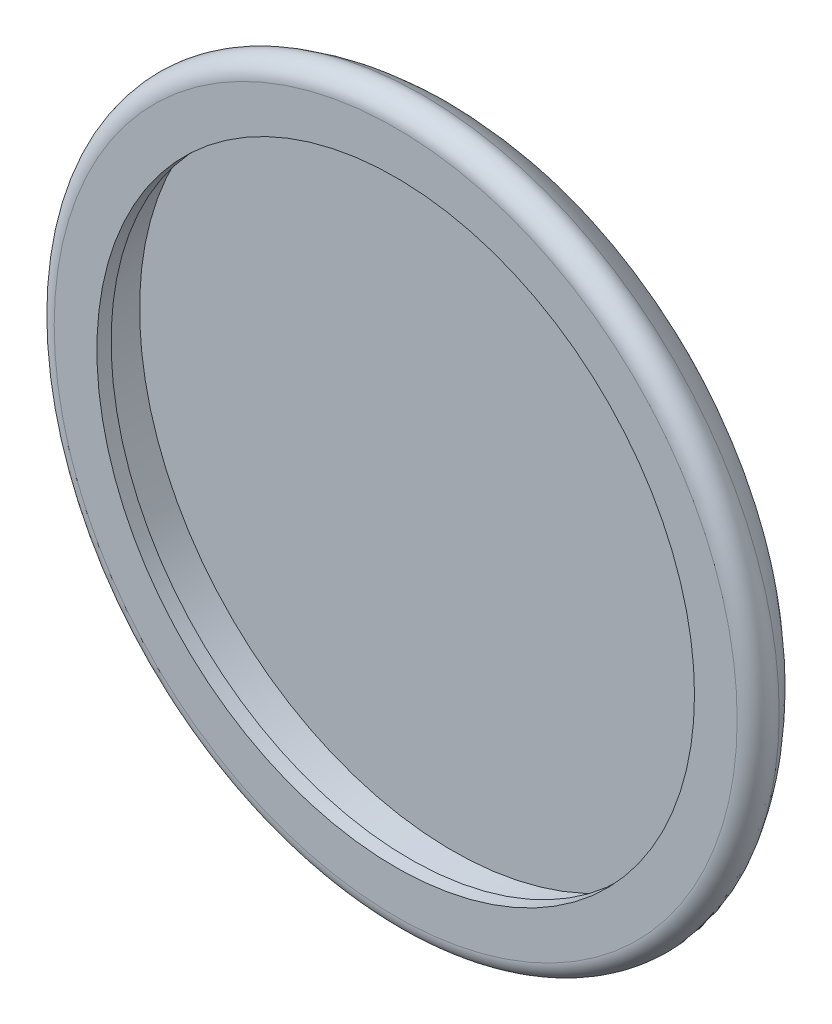
ISO-10303-21;
HEADER;
FILE_DESCRIPTION(('STEP AP214'),'2;1');
FILE_NAME('part.step','',(''),(''),'','','');
FILE_SCHEMA(('AUTOMOTIVE_DESIGN { 1 0 10303 214 1 1 1 1 }'));
ENDSEC;
DATA;
#1=APPLICATION_CONTEXT('core data for automotive mechanical design processes');
#2=APPLICATION_PROTOCOL_DEFINITION('international standard','automotive_design',2000,#1);
#3=PRODUCT_CONTEXT('',#1,'mechanical');
#4=PRODUCT('Part','Part','',(#3));
#5=PRODUCT_RELATED_PRODUCT_CATEGORY('part','',(#4));
#6=PRODUCT_DEFINITION_FORMATION('','',#4);
#7=PRODUCT_DEFINITION_CONTEXT('part definition',#1,'design');
#8=PRODUCT_DEFINITION('design','',#6,#7);
#9=PRODUCT_DEFINITION_SHAPE('','',#8);
#10=(LENGTH_UNIT() NAMED_UNIT(*) SI_UNIT(.MILLI.,.METRE.));
#11=(NAMED_UNIT(*) PLANE_ANGLE_UNIT() SI_UNIT($,.RADIAN.));
#12=(NAMED_UNIT(*) SI_UNIT($,.STERADIAN.) SOLID_ANGLE_UNIT());
#13=UNCERTAINTY_MEASURE_WITH_UNIT(LENGTH_MEASURE(1.E-05),#10,'distance_accuracy_value','');
#14=(GEOMETRIC_REPRESENTATION_CONTEXT(3) GLOBAL_UNCERTAINTY_ASSIGNED_CONTEXT((#13)) GLOBAL_UNIT_ASSIGNED_CONTEXT((#10,
#11,#12)) REPRESENTATION_CONTEXT('',''));
#15=CARTESIAN_POINT('',(0.,0.,0.));
#16=DIRECTION('',(0.,0.,1.));
#17=DIRECTION('',(1.,0.,0.));
#18=AXIS2_PLACEMENT_3D('',#15,#16,#17);
#19=CARTESIAN_POINT('',(0.,0.,-6.));
#20=DIRECTION('',(0.,0.,-1.));
#21=DIRECTION('',(-1.,0.,0.));
#22=AXIS2_PLACEMENT_3D('',#19,#20,#21);
#23=PLANE('',#22);
#24=CARTESIAN_POINT('',(0.,0.,-6.));
#25=DIRECTION('',(0.,0.,1.));
#26=DIRECTION('',(1.,0.,0.));
#27=AXIS2_PLACEMENT_3D('',#24,#25,#26);
#28=CIRCLE('',#27,18.);
#29=CARTESIAN_POINT('',(18.,0.,-6.));
#30=VERTEX_POINT('',#29);
#31=EDGE_CURVE('E10',#30,#30,#28,.T.);
#32=ORIENTED_EDGE('',*,*,#31,.F.);
#33=EDGE_LOOP('',(#32));
#34=FACE_BOUND('',#33,.T.);
#35=ADVANCED_FACE('F32',(#34),#23,.T.);
#36=CARTESIAN_POINT('',(0.,0.,2.14285714285715));
#37=DIRECTION('',(0.,0.,1.));
#38=DIRECTION('',(1.,0.,0.));
#39=AXIS2_PLACEMENT_3D('',#36,#37,#38);
#40=TOROIDAL_SURFACE('',#39,18.,8.14285714285714);
#41=ORIENTED_EDGE('',*,*,#31,.T.);
#42=EDGE_LOOP('',(#41));
#43=FACE_BOUND('',#42,.T.);
#44=CARTESIAN_POINT('',(0.,0.,-1.86528497409326));
#45=DIRECTION('',(0.,0.,1.));
#46=DIRECTION('',(1.,0.,0.));
#47=AXIS2_PLACEMENT_3D('',#44,#45,#46);
#48=CIRCLE('',#47,25.0880829015544);
#49=CARTESIAN_POINT('',(25.0880829015544,0.,-1.86528497409326));
#50=VERTEX_POINT('',#49);
#51=EDGE_CURVE('E38',#50,#50,#48,.T.);
#52=ORIENTED_EDGE('',*,*,#51,.F.);
#53=EDGE_LOOP('',(#52));
#54=FACE_BOUND('',#53,.T.);
#55=ADVANCED_FACE('F77',(#43,#54),#40,.T.);
#56=CARTESIAN_POINT('',(0.,0.,-1.25));
#57=DIRECTION('',(0.,0.,1.));
#58=DIRECTION('',(1.,0.,0.));
#59=AXIS2_PLACEMENT_3D('',#56,#57,#58);
#60=TOROIDAL_SURFACE('',#59,24.,1.25);
#61=ORIENTED_EDGE('',*,*,#51,.T.);
#62=EDGE_LOOP('',(#61));
#63=FACE_BOUND('',#62,.T.);
#64=CARTESIAN_POINT('',(0.,0.,0.));
#65=DIRECTION('',(0.,0.,1.));
#66=DIRECTION('',(1.,0.,0.));
#67=AXIS2_PLACEMENT_3D('',#64,#65,#66);
#68=CIRCLE('',#67,24.);
#69=CARTESIAN_POINT('',(24.,0.,0.));
#70=VERTEX_POINT('',#69);
#71=EDGE_CURVE('E42',#70,#70,#68,.T.);
#72=ORIENTED_EDGE('',*,*,#71,.F.);
#73=EDGE_LOOP('',(#72));
#74=FACE_BOUND('',#73,.T.);
#75=ADVANCED_FACE('F82',(#63,#74),#60,.T.);
#76=CARTESIAN_POINT('',(24.,0.,0.));
#77=DIRECTION('',(0.,0.,1.));
#78=DIRECTION('',(1.,0.,0.));
#79=AXIS2_PLACEMENT_3D('',#76,#77,#78);
#80=PLANE('',#79);
#81=ORIENTED_EDGE('',*,*,#71,.T.);
#82=EDGE_LOOP('',(#81));
#83=FACE_BOUND('',#82,.T.);
#84=CARTESIAN_POINT('',(0.,0.,0.));
#85=DIRECTION('',(0.,0.,1.));
#86=DIRECTION('',(1.,0.,0.));
#87=AXIS2_PLACEMENT_3D('',#84,#85,#86);
#88=CIRCLE('',#87,21.);
#89=CARTESIAN_POINT('',(21.,0.,0.));
#90=VERTEX_POINT('',#89);
#91=EDGE_CURVE('E46',#90,#90,#88,.T.);
#92=ORIENTED_EDGE('',*,*,#91,.F.);
#93=EDGE_LOOP('',(#92));
#94=FACE_BOUND('',#93,.T.);
#95=ADVANCED_FACE('F86',(#83,#94),#80,.T.);
#96=CARTESIAN_POINT('',(0.,0.,0.));
#97=DIRECTION('',(0.,0.,1.));
#98=DIRECTION('',(1.,0.,0.));
#99=AXIS2_PLACEMENT_3D('',#96,#97,#98);
#100=CYLINDRICAL_SURFACE('',#99,21.);
#101=ORIENTED_EDGE('',*,*,#91,.T.);
#102=EDGE_LOOP('',(#101));
#103=FACE_BOUND('',#102,.T.);
#104=CARTESIAN_POINT('',(0.,0.,-1.));
#105=DIRECTION('',(0.,0.,1.));
#106=DIRECTION('',(1.,0.,0.));
#107=AXIS2_PLACEMENT_3D('',#104,#105,#106);
#108=CIRCLE('',#107,21.);
#109=CARTESIAN_POINT('',(21.,0.,-1.));
#110=VERTEX_POINT('',#109);
#111=EDGE_CURVE('E51',#110,#110,#108,.T.);
#112=ORIENTED_EDGE('',*,*,#111,.F.);
#113=EDGE_LOOP('',(#112));
#114=FACE_BOUND('',#113,.T.);
#115=ADVANCED_FACE('F73',(#103,#114),#100,.F.);
#116=CARTESIAN_POINT('',(21.,0.,-1.));
#117=DIRECTION('',(0.,0.,-1.));
#118=DIRECTION('',(-1.,0.,0.));
#119=AXIS2_PLACEMENT_3D('',#116,#117,#118);
#120=PLANE('',#119);
#121=ORIENTED_EDGE('',*,*,#111,.T.);
#122=EDGE_LOOP('',(#121));
#123=FACE_BOUND('',#122,.T.);
#124=CARTESIAN_POINT('',(0.,0.,-1.));
#125=DIRECTION('',(0.,0.,1.));
#126=DIRECTION('',(1.,0.,0.));
#127=AXIS2_PLACEMENT_3D('',#124,#125,#126);
#128=CIRCLE('',#127,22.);
#129=CARTESIAN_POINT('',(22.,0.,-1.));
#130=VERTEX_POINT('',#129);
#131=EDGE_CURVE('E54',#130,#130,#128,.T.);
#132=ORIENTED_EDGE('',*,*,#131,.F.);
#133=EDGE_LOOP('',(#132));
#134=FACE_BOUND('',#133,.T.);
#135=ADVANCED_FACE('F65',(#123,#134),#120,.T.);
#136=CARTESIAN_POINT('',(0.,0.,0.));
#137=DIRECTION('',(0.,0.,1.));
#138=DIRECTION('',(1.,0.,0.));
#139=AXIS2_PLACEMENT_3D('',#136,#137,#138);
#140=CYLINDRICAL_SURFACE('',#139,22.);
#141=ORIENTED_EDGE('',*,*,#131,.T.);
#142=EDGE_LOOP('',(#141));
#143=FACE_BOUND('',#142,.T.);
#144=CARTESIAN_POINT('',(0.,0.,-4.));
#145=DIRECTION('',(0.,0.,1.));
#146=DIRECTION('',(1.,0.,0.));
#147=AXIS2_PLACEMENT_3D('',#144,#145,#146);
#148=CIRCLE('',#147,22.);
#149=CARTESIAN_POINT('',(22.,0.,-4.));
#150=VERTEX_POINT('',#149);
#151=EDGE_CURVE('E57',#150,#150,#148,.T.);
#152=ORIENTED_EDGE('',*,*,#151,.F.);
#153=EDGE_LOOP('',(#152));
#154=FACE_BOUND('',#153,.T.);
#155=ADVANCED_FACE('F63',(#143,#154),#140,.F.);
#156=CARTESIAN_POINT('',(0.,0.,-4.));
#157=DIRECTION('',(0.,0.,1.));
#158=DIRECTION('',(1.,0.,0.));
#159=AXIS2_PLACEMENT_3D('',#156,#157,#158);
#160=PLANE('',#159);
#161=ORIENTED_EDGE('',*,*,#151,.T.);
#162=EDGE_LOOP('',(#161));
#163=FACE_BOUND('',#162,.T.);
#164=ADVANCED_FACE('F61',(#163),#160,.T.);
#165=CLOSED_SHELL('',(#35,#55,#75,#95,#115,#135,#155,#164));
#166=MANIFOLD_SOLID_BREP('B2',#165);
#167=ADVANCED_BREP_SHAPE_REPRESENTATION('',(#18,#166),#14);
#168=SHAPE_DEFINITION_REPRESENTATION(#9,#167);
ENDSEC;
END-ISO-10303-21;
